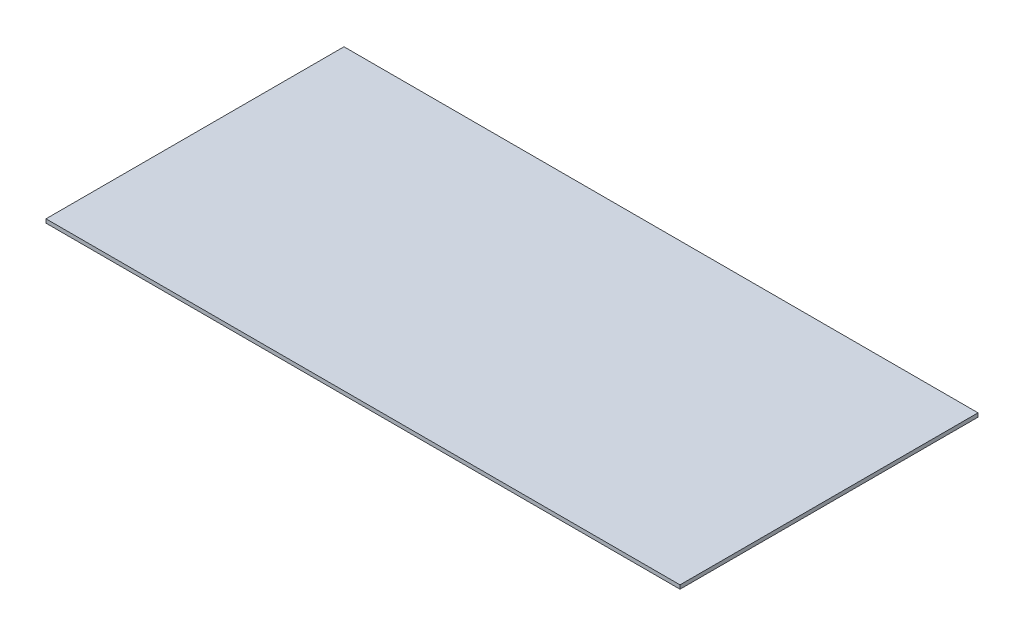
ISO-10303-21;
HEADER;
FILE_DESCRIPTION(('STEP AP214'),'2;1');
FILE_NAME('part.step','',(''),(''),'','','');
FILE_SCHEMA(('AUTOMOTIVE_DESIGN { 1 0 10303 214 1 1 1 1 }'));
ENDSEC;
DATA;
#1=APPLICATION_CONTEXT('core data for automotive mechanical design processes');
#2=APPLICATION_PROTOCOL_DEFINITION('international standard','automotive_design',2000,#1);
#3=PRODUCT_CONTEXT('',#1,'mechanical');
#4=PRODUCT('Part','Part','',(#3));
#5=PRODUCT_RELATED_PRODUCT_CATEGORY('part','',(#4));
#6=PRODUCT_DEFINITION_FORMATION('','',#4);
#7=PRODUCT_DEFINITION_CONTEXT('part definition',#1,'design');
#8=PRODUCT_DEFINITION('design','',#6,#7);
#9=PRODUCT_DEFINITION_SHAPE('','',#8);
#10=(LENGTH_UNIT() NAMED_UNIT(*) SI_UNIT(.MILLI.,.METRE.));
#11=(NAMED_UNIT(*) PLANE_ANGLE_UNIT() SI_UNIT($,.RADIAN.));
#12=(NAMED_UNIT(*) SI_UNIT($,.STERADIAN.) SOLID_ANGLE_UNIT());
#13=UNCERTAINTY_MEASURE_WITH_UNIT(LENGTH_MEASURE(1.E-05),#10,'distance_accuracy_value','');
#14=(GEOMETRIC_REPRESENTATION_CONTEXT(3) GLOBAL_UNCERTAINTY_ASSIGNED_CONTEXT((#13)) GLOBAL_UNIT_ASSIGNED_CONTEXT((#10,
#11,#12)) REPRESENTATION_CONTEXT('',''));
#15=CARTESIAN_POINT('',(0.,0.,0.));
#16=DIRECTION('',(0.,0.,1.));
#17=DIRECTION('',(1.,0.,0.));
#18=AXIS2_PLACEMENT_3D('',#15,#16,#17);
#19=CARTESIAN_POINT('',(-250.,3.,117.5));
#20=DIRECTION('',(1.,0.,0.));
#21=DIRECTION('',(0.,0.,-1.));
#22=AXIS2_PLACEMENT_3D('',#19,#20,#21);
#23=PLANE('',#22);
#24=DIRECTION('',(0.,0.,1.));
#25=VECTOR('',#24,1.);
#26=CARTESIAN_POINT('',(-250.,0.,117.5));
#27=LINE('',#26,#25);
#28=CARTESIAN_POINT('',(-250.,0.,-117.5));
#29=VERTEX_POINT('',#28);
#30=CARTESIAN_POINT('',(-250.,0.,117.5));
#31=VERTEX_POINT('',#30);
#32=EDGE_CURVE('E87',#29,#31,#27,.T.);
#33=ORIENTED_EDGE('',*,*,#32,.T.);
#34=DIRECTION('',(0.,-1.,0.));
#35=VECTOR('',#34,1.);
#36=CARTESIAN_POINT('',(-250.,3.,117.5));
#37=LINE('',#36,#35);
#38=CARTESIAN_POINT('',(-250.,3.,117.5));
#39=VERTEX_POINT('',#38);
#40=EDGE_CURVE('E41',#39,#31,#37,.T.);
#41=ORIENTED_EDGE('',*,*,#40,.F.);
#42=DIRECTION('',(0.,0.,1.));
#43=VECTOR('',#42,1.);
#44=CARTESIAN_POINT('',(-250.,3.,117.5));
#45=LINE('',#44,#43);
#46=CARTESIAN_POINT('',(-250.,3.,-117.5));
#47=VERTEX_POINT('',#46);
#48=EDGE_CURVE('E80',#47,#39,#45,.T.);
#49=ORIENTED_EDGE('',*,*,#48,.F.);
#50=DIRECTION('',(0.,-1.,0.));
#51=VECTOR('',#50,1.);
#52=CARTESIAN_POINT('',(-250.,3.,-117.5));
#53=LINE('',#52,#51);
#54=EDGE_CURVE('E11',#47,#29,#53,.T.);
#55=ORIENTED_EDGE('',*,*,#54,.T.);
#56=EDGE_LOOP('',(#33,#41,#49,#55));
#57=FACE_BOUND('',#56,.T.);
#58=ADVANCED_FACE('F33',(#57),#23,.F.);
#59=CARTESIAN_POINT('',(250.,3.,117.5));
#60=DIRECTION('',(0.,0.,-1.));
#61=DIRECTION('',(-1.,0.,0.));
#62=AXIS2_PLACEMENT_3D('',#59,#60,#61);
#63=PLANE('',#62);
#64=DIRECTION('',(1.,0.,0.));
#65=VECTOR('',#64,1.);
#66=CARTESIAN_POINT('',(250.,0.,117.5));
#67=LINE('',#66,#65);
#68=CARTESIAN_POINT('',(250.,0.,117.5));
#69=VERTEX_POINT('',#68);
#70=EDGE_CURVE('E67',#31,#69,#67,.T.);
#71=ORIENTED_EDGE('',*,*,#70,.T.);
#72=DIRECTION('',(0.,-1.,0.));
#73=VECTOR('',#72,1.);
#74=CARTESIAN_POINT('',(250.,3.,117.5));
#75=LINE('',#74,#73);
#76=CARTESIAN_POINT('',(250.,3.,117.5));
#77=VERTEX_POINT('',#76);
#78=EDGE_CURVE('E88',#77,#69,#75,.T.);
#79=ORIENTED_EDGE('',*,*,#78,.F.);
#80=DIRECTION('',(1.,0.,0.));
#81=VECTOR('',#80,1.);
#82=CARTESIAN_POINT('',(250.,3.,117.5));
#83=LINE('',#82,#81);
#84=EDGE_CURVE('E84',#39,#77,#83,.T.);
#85=ORIENTED_EDGE('',*,*,#84,.F.);
#86=ORIENTED_EDGE('',*,*,#40,.T.);
#87=EDGE_LOOP('',(#71,#79,#85,#86));
#88=FACE_BOUND('',#87,.T.);
#89=ADVANCED_FACE('F89',(#88),#63,.F.);
#90=CARTESIAN_POINT('',(250.,3.,-117.5));
#91=DIRECTION('',(-1.,0.,0.));
#92=DIRECTION('',(0.,0.,1.));
#93=AXIS2_PLACEMENT_3D('',#90,#91,#92);
#94=PLANE('',#93);
#95=DIRECTION('',(0.,0.,-1.));
#96=VECTOR('',#95,1.);
#97=CARTESIAN_POINT('',(250.,0.,-117.5));
#98=LINE('',#97,#96);
#99=CARTESIAN_POINT('',(250.,0.,-117.5));
#100=VERTEX_POINT('',#99);
#101=EDGE_CURVE('E74',#69,#100,#98,.T.);
#102=ORIENTED_EDGE('',*,*,#101,.T.);
#103=DIRECTION('',(0.,-1.,0.));
#104=VECTOR('',#103,1.);
#105=CARTESIAN_POINT('',(250.,3.,-117.5));
#106=LINE('',#105,#104);
#107=CARTESIAN_POINT('',(250.,3.,-117.5));
#108=VERTEX_POINT('',#107);
#109=EDGE_CURVE('E93',#108,#100,#106,.T.);
#110=ORIENTED_EDGE('',*,*,#109,.F.);
#111=DIRECTION('',(0.,0.,-1.));
#112=VECTOR('',#111,1.);
#113=CARTESIAN_POINT('',(250.,3.,-117.5));
#114=LINE('',#113,#112);
#115=EDGE_CURVE('E91',#77,#108,#114,.T.);
#116=ORIENTED_EDGE('',*,*,#115,.F.);
#117=ORIENTED_EDGE('',*,*,#78,.T.);
#118=EDGE_LOOP('',(#102,#110,#116,#117));
#119=FACE_BOUND('',#118,.T.);
#120=ADVANCED_FACE('F103',(#119),#94,.F.);
#121=CARTESIAN_POINT('',(170.,3.,-117.5));
#122=DIRECTION('',(0.,0.,1.));
#123=DIRECTION('',(1.,0.,0.));
#124=AXIS2_PLACEMENT_3D('',#121,#122,#123);
#125=PLANE('',#124);
#126=DIRECTION('',(-1.,0.,0.));
#127=VECTOR('',#126,1.);
#128=CARTESIAN_POINT('',(170.,0.,-117.5));
#129=LINE('',#128,#127);
#130=EDGE_CURVE('E100',#100,#29,#129,.T.);
#131=ORIENTED_EDGE('',*,*,#130,.T.);
#132=ORIENTED_EDGE('',*,*,#54,.F.);
#133=DIRECTION('',(-1.,0.,0.));
#134=VECTOR('',#133,1.);
#135=CARTESIAN_POINT('',(-250.,3.,-117.5));
#136=LINE('',#135,#134);
#137=EDGE_CURVE('E49',#108,#47,#136,.T.);
#138=ORIENTED_EDGE('',*,*,#137,.F.);
#139=ORIENTED_EDGE('',*,*,#109,.T.);
#140=EDGE_LOOP('',(#131,#132,#138,#139));
#141=FACE_BOUND('',#140,.T.);
#142=ADVANCED_FACE('F107',(#141),#125,.F.);
#143=CARTESIAN_POINT('',(0.,3.,0.));
#144=DIRECTION('',(0.,-1.,0.));
#145=DIRECTION('',(0.,0.,-1.));
#146=AXIS2_PLACEMENT_3D('',#143,#144,#145);
#147=PLANE('',#146);
#148=ORIENTED_EDGE('',*,*,#137,.T.);
#149=ORIENTED_EDGE('',*,*,#48,.T.);
#150=ORIENTED_EDGE('',*,*,#84,.T.);
#151=ORIENTED_EDGE('',*,*,#115,.T.);
#152=EDGE_LOOP('',(#148,#149,#150,#151));
#153=FACE_BOUND('',#152,.T.);
#154=ADVANCED_FACE('F82',(#153),#147,.F.);
#155=CARTESIAN_POINT('',(0.,0.,0.));
#156=DIRECTION('',(0.,-1.,0.));
#157=DIRECTION('',(0.,0.,-1.));
#158=AXIS2_PLACEMENT_3D('',#155,#156,#157);
#159=PLANE('',#158);
#160=ORIENTED_EDGE('',*,*,#32,.F.);
#161=ORIENTED_EDGE('',*,*,#130,.F.);
#162=ORIENTED_EDGE('',*,*,#101,.F.);
#163=ORIENTED_EDGE('',*,*,#70,.F.);
#164=EDGE_LOOP('',(#160,#161,#162,#163));
#165=FACE_BOUND('',#164,.T.);
#166=ADVANCED_FACE('F106',(#165),#159,.T.);
#167=CLOSED_SHELL('',(#58,#89,#120,#142,#154,#166));
#168=MANIFOLD_SOLID_BREP('B2',#167);
#169=ADVANCED_BREP_SHAPE_REPRESENTATION('',(#18,#168),#14);
#170=SHAPE_DEFINITION_REPRESENTATION(#9,#169);
ENDSEC;
END-ISO-10303-21;
